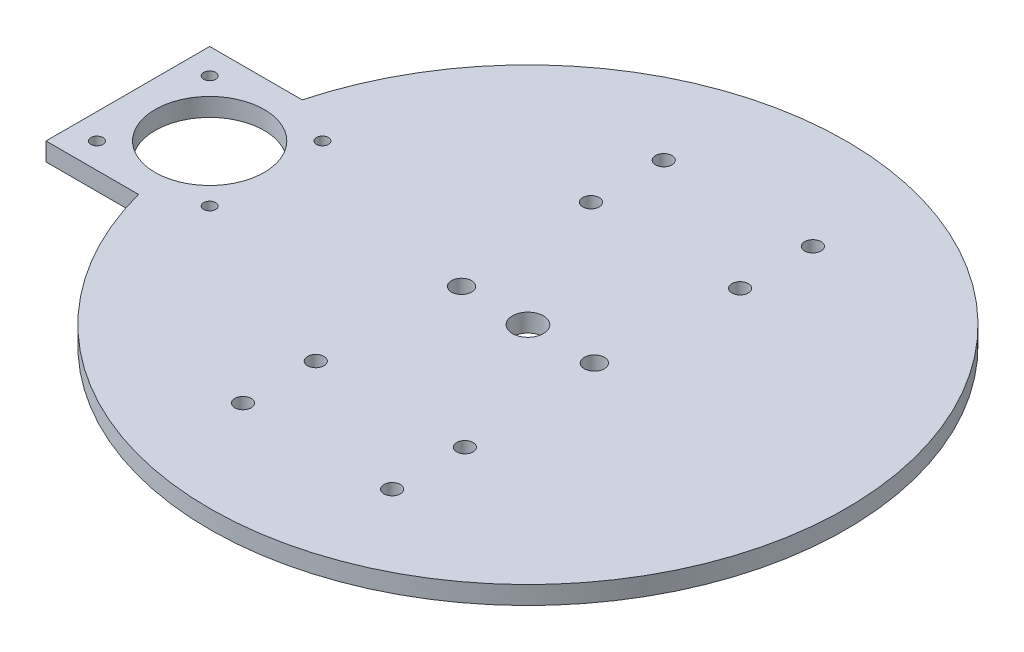
ISO-10303-21;
HEADER;
FILE_DESCRIPTION(('STEP AP214'),'2;1');
FILE_NAME('part.step','',(''),(''),'','','');
FILE_SCHEMA(('AUTOMOTIVE_DESIGN { 1 0 10303 214 1 1 1 1 }'));
ENDSEC;
DATA;
#1=APPLICATION_CONTEXT('core data for automotive mechanical design processes');
#2=APPLICATION_PROTOCOL_DEFINITION('international standard','automotive_design',2000,#1);
#3=PRODUCT_CONTEXT('',#1,'mechanical');
#4=PRODUCT('Part','Part','',(#3));
#5=PRODUCT_RELATED_PRODUCT_CATEGORY('part','',(#4));
#6=PRODUCT_DEFINITION_FORMATION('','',#4);
#7=PRODUCT_DEFINITION_CONTEXT('part definition',#1,'design');
#8=PRODUCT_DEFINITION('design','',#6,#7);
#9=PRODUCT_DEFINITION_SHAPE('','',#8);
#10=(LENGTH_UNIT() NAMED_UNIT(*) SI_UNIT(.MILLI.,.METRE.));
#11=(NAMED_UNIT(*) PLANE_ANGLE_UNIT() SI_UNIT($,.RADIAN.));
#12=(NAMED_UNIT(*) SI_UNIT($,.STERADIAN.) SOLID_ANGLE_UNIT());
#13=UNCERTAINTY_MEASURE_WITH_UNIT(LENGTH_MEASURE(1.E-05),#10,'distance_accuracy_value','');
#14=(GEOMETRIC_REPRESENTATION_CONTEXT(3) GLOBAL_UNCERTAINTY_ASSIGNED_CONTEXT((#13)) GLOBAL_UNIT_ASSIGNED_CONTEXT((#10,
#11,#12)) REPRESENTATION_CONTEXT('',''));
#15=CARTESIAN_POINT('',(0.,0.,0.));
#16=DIRECTION('',(0.,0.,1.));
#17=DIRECTION('',(1.,0.,0.));
#18=AXIS2_PLACEMENT_3D('',#15,#16,#17);
#19=CARTESIAN_POINT('',(20.5,5.,57.8302078853901));
#20=DIRECTION('',(0.,-1.,0.));
#21=DIRECTION('',(0.,0.,-1.));
#22=AXIS2_PLACEMENT_3D('',#19,#20,#21);
#23=CYLINDRICAL_SURFACE('',#22,2.25);
#24=CARTESIAN_POINT('',(20.5,5.,57.8302078853901));
#25=DIRECTION('',(0.,1.,0.));
#26=DIRECTION('',(0.,0.,1.));
#27=AXIS2_PLACEMENT_3D('',#24,#25,#26);
#28=CIRCLE('',#27,2.25);
#29=CARTESIAN_POINT('',(20.5,5.,60.0802078853901));
#30=VERTEX_POINT('',#29);
#31=EDGE_CURVE('E208',#30,#30,#28,.F.);
#32=ORIENTED_EDGE('',*,*,#31,.F.);
#33=EDGE_LOOP('',(#32));
#34=FACE_BOUND('',#33,.T.);
#35=CARTESIAN_POINT('',(20.5,0.,57.8302078853901));
#36=DIRECTION('',(0.,1.,0.));
#37=DIRECTION('',(0.,0.,1.));
#38=AXIS2_PLACEMENT_3D('',#35,#36,#37);
#39=CIRCLE('',#38,2.25);
#40=CARTESIAN_POINT('',(20.5,0.,60.0802078853901));
#41=VERTEX_POINT('',#40);
#42=EDGE_CURVE('E258',#41,#41,#39,.F.);
#43=ORIENTED_EDGE('',*,*,#42,.T.);
#44=EDGE_LOOP('',(#43));
#45=FACE_BOUND('',#44,.T.);
#46=ADVANCED_FACE('F109',(#34,#45),#23,.F.);
#47=CARTESIAN_POINT('',(-20.5,5.,57.8302078853901));
#48=DIRECTION('',(0.,-1.,0.));
#49=DIRECTION('',(0.,0.,-1.));
#50=AXIS2_PLACEMENT_3D('',#47,#48,#49);
#51=CYLINDRICAL_SURFACE('',#50,2.25);
#52=CARTESIAN_POINT('',(-20.5,5.,57.8302078853901));
#53=DIRECTION('',(0.,1.,0.));
#54=DIRECTION('',(0.,0.,1.));
#55=AXIS2_PLACEMENT_3D('',#52,#53,#54);
#56=CIRCLE('',#55,2.25);
#57=CARTESIAN_POINT('',(-20.5,5.,60.0802078853901));
#58=VERTEX_POINT('',#57);
#59=EDGE_CURVE('E205',#58,#58,#56,.F.);
#60=ORIENTED_EDGE('',*,*,#59,.F.);
#61=EDGE_LOOP('',(#60));
#62=FACE_BOUND('',#61,.T.);
#63=CARTESIAN_POINT('',(-20.5,0.,57.8302078853901));
#64=DIRECTION('',(0.,1.,0.));
#65=DIRECTION('',(0.,0.,1.));
#66=AXIS2_PLACEMENT_3D('',#63,#64,#65);
#67=CIRCLE('',#66,2.25);
#68=CARTESIAN_POINT('',(-20.5,0.,60.0802078853901));
#69=VERTEX_POINT('',#68);
#70=EDGE_CURVE('E255',#69,#69,#67,.F.);
#71=ORIENTED_EDGE('',*,*,#70,.T.);
#72=EDGE_LOOP('',(#71));
#73=FACE_BOUND('',#72,.T.);
#74=ADVANCED_FACE('F287',(#62,#73),#51,.F.);
#75=CARTESIAN_POINT('',(20.5,5.,37.8302078853901));
#76=DIRECTION('',(0.,-1.,0.));
#77=DIRECTION('',(0.,0.,-1.));
#78=AXIS2_PLACEMENT_3D('',#75,#76,#77);
#79=CYLINDRICAL_SURFACE('',#78,2.25000000000019);
#80=CARTESIAN_POINT('',(20.5,5.,37.8302078853901));
#81=DIRECTION('',(0.,1.,0.));
#82=DIRECTION('',(0.,0.,1.));
#83=AXIS2_PLACEMENT_3D('',#80,#81,#82);
#84=CIRCLE('',#83,2.25000000000019);
#85=CARTESIAN_POINT('',(20.5,5.,40.0802078853902));
#86=VERTEX_POINT('',#85);
#87=EDGE_CURVE('E202',#86,#86,#84,.F.);
#88=ORIENTED_EDGE('',*,*,#87,.F.);
#89=EDGE_LOOP('',(#88));
#90=FACE_BOUND('',#89,.T.);
#91=CARTESIAN_POINT('',(20.5,0.,37.8302078853901));
#92=DIRECTION('',(0.,1.,0.));
#93=DIRECTION('',(0.,0.,1.));
#94=AXIS2_PLACEMENT_3D('',#91,#92,#93);
#95=CIRCLE('',#94,2.25000000000019);
#96=CARTESIAN_POINT('',(20.5,0.,40.0802078853902));
#97=VERTEX_POINT('',#96);
#98=EDGE_CURVE('E252',#97,#97,#95,.F.);
#99=ORIENTED_EDGE('',*,*,#98,.T.);
#100=EDGE_LOOP('',(#99));
#101=FACE_BOUND('',#100,.T.);
#102=ADVANCED_FACE('F293',(#90,#101),#79,.F.);
#103=CARTESIAN_POINT('',(-72.,5.,-15.5));
#104=DIRECTION('',(0.,-1.,0.));
#105=DIRECTION('',(0.,0.,-1.));
#106=AXIS2_PLACEMENT_3D('',#103,#104,#105);
#107=CYLINDRICAL_SURFACE('',#106,1.65);
#108=CARTESIAN_POINT('',(-72.,5.,-15.5));
#109=DIRECTION('',(0.,1.,0.));
#110=DIRECTION('',(0.,0.,1.));
#111=AXIS2_PLACEMENT_3D('',#108,#109,#110);
#112=CIRCLE('',#111,1.65);
#113=CARTESIAN_POINT('',(-72.,5.,-13.85));
#114=VERTEX_POINT('',#113);
#115=EDGE_CURVE('E199',#114,#114,#112,.T.);
#116=ORIENTED_EDGE('',*,*,#115,.T.);
#117=EDGE_LOOP('',(#116));
#118=FACE_BOUND('',#117,.T.);
#119=CARTESIAN_POINT('',(-72.,0.,-15.5));
#120=DIRECTION('',(0.,1.,0.));
#121=DIRECTION('',(0.,0.,1.));
#122=AXIS2_PLACEMENT_3D('',#119,#120,#121);
#123=CIRCLE('',#122,1.65);
#124=CARTESIAN_POINT('',(-72.,0.,-13.85));
#125=VERTEX_POINT('',#124);
#126=EDGE_CURVE('E249',#125,#125,#123,.T.);
#127=ORIENTED_EDGE('',*,*,#126,.F.);
#128=EDGE_LOOP('',(#127));
#129=FACE_BOUND('',#128,.T.);
#130=ADVANCED_FACE('F302',(#118,#129),#107,.F.);
#131=CARTESIAN_POINT('',(-71.9999999999997,5.,15.5));
#132=DIRECTION('',(0.,-1.,0.));
#133=DIRECTION('',(0.,0.,-1.));
#134=AXIS2_PLACEMENT_3D('',#131,#132,#133);
#135=CYLINDRICAL_SURFACE('',#134,1.65);
#136=CARTESIAN_POINT('',(-71.9999999999997,5.,15.5));
#137=DIRECTION('',(0.,1.,0.));
#138=DIRECTION('',(0.,0.,1.));
#139=AXIS2_PLACEMENT_3D('',#136,#137,#138);
#140=CIRCLE('',#139,1.65);
#141=CARTESIAN_POINT('',(-71.9999999999997,5.,17.15));
#142=VERTEX_POINT('',#141);
#143=EDGE_CURVE('E196',#142,#142,#140,.T.);
#144=ORIENTED_EDGE('',*,*,#143,.T.);
#145=EDGE_LOOP('',(#144));
#146=FACE_BOUND('',#145,.T.);
#147=CARTESIAN_POINT('',(-71.9999999999997,0.,15.5));
#148=DIRECTION('',(0.,1.,0.));
#149=DIRECTION('',(0.,0.,1.));
#150=AXIS2_PLACEMENT_3D('',#147,#148,#149);
#151=CIRCLE('',#150,1.65);
#152=CARTESIAN_POINT('',(-71.9999999999997,0.,17.15));
#153=VERTEX_POINT('',#152);
#154=EDGE_CURVE('E246',#153,#153,#151,.T.);
#155=ORIENTED_EDGE('',*,*,#154,.F.);
#156=EDGE_LOOP('',(#155));
#157=FACE_BOUND('',#156,.T.);
#158=ADVANCED_FACE('F306',(#146,#157),#135,.F.);
#159=CARTESIAN_POINT('',(0.,5.,0.));
#160=DIRECTION('',(0.,-1.,0.));
#161=DIRECTION('',(0.,0.,-1.));
#162=AXIS2_PLACEMENT_3D('',#159,#160,#161);
#163=CYLINDRICAL_SURFACE('',#162,4.25);
#164=CARTESIAN_POINT('',(0.,5.,0.));
#165=DIRECTION('',(0.,1.,0.));
#166=DIRECTION('',(0.,0.,1.));
#167=AXIS2_PLACEMENT_3D('',#164,#165,#166);
#168=CIRCLE('',#167,4.25);
#169=CARTESIAN_POINT('',(0.,5.,4.25));
#170=VERTEX_POINT('',#169);
#171=EDGE_CURVE('E193',#170,#170,#168,.T.);
#172=ORIENTED_EDGE('',*,*,#171,.T.);
#173=EDGE_LOOP('',(#172));
#174=FACE_BOUND('',#173,.T.);
#175=CARTESIAN_POINT('',(0.,0.,0.));
#176=DIRECTION('',(0.,1.,0.));
#177=DIRECTION('',(0.,0.,1.));
#178=AXIS2_PLACEMENT_3D('',#175,#176,#177);
#179=CIRCLE('',#178,4.25);
#180=CARTESIAN_POINT('',(0.,0.,4.25));
#181=VERTEX_POINT('',#180);
#182=EDGE_CURVE('E243',#181,#181,#179,.T.);
#183=ORIENTED_EDGE('',*,*,#182,.F.);
#184=EDGE_LOOP('',(#183));
#185=FACE_BOUND('',#184,.T.);
#186=ADVANCED_FACE('F310',(#174,#185),#163,.F.);
#187=CARTESIAN_POINT('',(18.25,5.,0.));
#188=DIRECTION('',(0.,-1.,0.));
#189=DIRECTION('',(0.,0.,-1.));
#190=AXIS2_PLACEMENT_3D('',#187,#188,#189);
#191=CYLINDRICAL_SURFACE('',#190,2.75);
#192=CARTESIAN_POINT('',(18.25,5.,0.));
#193=DIRECTION('',(0.,1.,0.));
#194=DIRECTION('',(0.,0.,1.));
#195=AXIS2_PLACEMENT_3D('',#192,#193,#194);
#196=CIRCLE('',#195,2.75);
#197=CARTESIAN_POINT('',(18.25,5.,2.75));
#198=VERTEX_POINT('',#197);
#199=EDGE_CURVE('E190',#198,#198,#196,.T.);
#200=ORIENTED_EDGE('',*,*,#199,.T.);
#201=EDGE_LOOP('',(#200));
#202=FACE_BOUND('',#201,.T.);
#203=CARTESIAN_POINT('',(18.25,0.,0.));
#204=DIRECTION('',(0.,1.,0.));
#205=DIRECTION('',(0.,0.,1.));
#206=AXIS2_PLACEMENT_3D('',#203,#204,#205);
#207=CIRCLE('',#206,2.75);
#208=CARTESIAN_POINT('',(18.25,0.,2.75));
#209=VERTEX_POINT('',#208);
#210=EDGE_CURVE('E240',#209,#209,#207,.T.);
#211=ORIENTED_EDGE('',*,*,#210,.F.);
#212=EDGE_LOOP('',(#211));
#213=FACE_BOUND('',#212,.T.);
#214=ADVANCED_FACE('F314',(#202,#213),#191,.F.);
#215=CARTESIAN_POINT('',(-18.25,5.,0.));
#216=DIRECTION('',(0.,-1.,0.));
#217=DIRECTION('',(0.,0.,-1.));
#218=AXIS2_PLACEMENT_3D('',#215,#216,#217);
#219=CYLINDRICAL_SURFACE('',#218,2.75);
#220=CARTESIAN_POINT('',(-18.25,5.,0.));
#221=DIRECTION('',(0.,1.,0.));
#222=DIRECTION('',(0.,0.,1.));
#223=AXIS2_PLACEMENT_3D('',#220,#221,#222);
#224=CIRCLE('',#223,2.75);
#225=CARTESIAN_POINT('',(-18.25,5.,2.75));
#226=VERTEX_POINT('',#225);
#227=EDGE_CURVE('E187',#226,#226,#224,.T.);
#228=ORIENTED_EDGE('',*,*,#227,.T.);
#229=EDGE_LOOP('',(#228));
#230=FACE_BOUND('',#229,.T.);
#231=CARTESIAN_POINT('',(-18.25,0.,0.));
#232=DIRECTION('',(0.,1.,0.));
#233=DIRECTION('',(0.,0.,1.));
#234=AXIS2_PLACEMENT_3D('',#231,#232,#233);
#235=CIRCLE('',#234,2.75);
#236=CARTESIAN_POINT('',(-18.25,0.,2.75));
#237=VERTEX_POINT('',#236);
#238=EDGE_CURVE('E237',#237,#237,#235,.T.);
#239=ORIENTED_EDGE('',*,*,#238,.F.);
#240=EDGE_LOOP('',(#239));
#241=FACE_BOUND('',#240,.T.);
#242=ADVANCED_FACE('F318',(#230,#241),#219,.F.);
#243=CARTESIAN_POINT('',(20.5000000000002,5.,-37.8302078853901));
#244=DIRECTION('',(0.,-1.,0.));
#245=DIRECTION('',(0.,0.,-1.));
#246=AXIS2_PLACEMENT_3D('',#243,#244,#245);
#247=CYLINDRICAL_SURFACE('',#246,2.25);
#248=CARTESIAN_POINT('',(20.5000000000002,5.,-37.8302078853901));
#249=DIRECTION('',(0.,1.,0.));
#250=DIRECTION('',(0.,0.,1.));
#251=AXIS2_PLACEMENT_3D('',#248,#249,#250);
#252=CIRCLE('',#251,2.25);
#253=CARTESIAN_POINT('',(20.5000000000002,5.,-35.58020788539));
#254=VERTEX_POINT('',#253);
#255=EDGE_CURVE('E184',#254,#254,#252,.T.);
#256=ORIENTED_EDGE('',*,*,#255,.T.);
#257=EDGE_LOOP('',(#256));
#258=FACE_BOUND('',#257,.T.);
#259=CARTESIAN_POINT('',(20.5000000000002,0.,-37.8302078853901));
#260=DIRECTION('',(0.,1.,0.));
#261=DIRECTION('',(0.,0.,1.));
#262=AXIS2_PLACEMENT_3D('',#259,#260,#261);
#263=CIRCLE('',#262,2.25);
#264=CARTESIAN_POINT('',(20.5000000000002,0.,-35.58020788539));
#265=VERTEX_POINT('',#264);
#266=EDGE_CURVE('E234',#265,#265,#263,.T.);
#267=ORIENTED_EDGE('',*,*,#266,.F.);
#268=EDGE_LOOP('',(#267));
#269=FACE_BOUND('',#268,.T.);
#270=ADVANCED_FACE('F322',(#258,#269),#247,.F.);
#271=CARTESIAN_POINT('',(-20.4999999999998,5.,-37.8302078853901));
#272=DIRECTION('',(0.,-1.,0.));
#273=DIRECTION('',(0.,0.,-1.));
#274=AXIS2_PLACEMENT_3D('',#271,#272,#273);
#275=CYLINDRICAL_SURFACE('',#274,2.25);
#276=CARTESIAN_POINT('',(-20.4999999999998,5.,-37.8302078853901));
#277=DIRECTION('',(0.,1.,0.));
#278=DIRECTION('',(0.,0.,1.));
#279=AXIS2_PLACEMENT_3D('',#276,#277,#278);
#280=CIRCLE('',#279,2.25);
#281=CARTESIAN_POINT('',(-20.4999999999998,5.,-35.58020788539));
#282=VERTEX_POINT('',#281);
#283=EDGE_CURVE('E181',#282,#282,#280,.T.);
#284=ORIENTED_EDGE('',*,*,#283,.T.);
#285=EDGE_LOOP('',(#284));
#286=FACE_BOUND('',#285,.T.);
#287=CARTESIAN_POINT('',(-20.4999999999998,0.,-37.8302078853901));
#288=DIRECTION('',(0.,1.,0.));
#289=DIRECTION('',(0.,0.,1.));
#290=AXIS2_PLACEMENT_3D('',#287,#288,#289);
#291=CIRCLE('',#290,2.25);
#292=CARTESIAN_POINT('',(-20.4999999999998,0.,-35.58020788539));
#293=VERTEX_POINT('',#292);
#294=EDGE_CURVE('E231',#293,#293,#291,.T.);
#295=ORIENTED_EDGE('',*,*,#294,.F.);
#296=EDGE_LOOP('',(#295));
#297=FACE_BOUND('',#296,.T.);
#298=ADVANCED_FACE('F326',(#286,#297),#275,.F.);
#299=CARTESIAN_POINT('',(-20.5,5.,37.8302078853901));
#300=DIRECTION('',(0.,-1.,0.));
#301=DIRECTION('',(0.,0.,-1.));
#302=AXIS2_PLACEMENT_3D('',#299,#300,#301);
#303=CYLINDRICAL_SURFACE('',#302,2.25000000000019);
#304=CARTESIAN_POINT('',(-20.5,5.,37.8302078853901));
#305=DIRECTION('',(0.,1.,0.));
#306=DIRECTION('',(0.,0.,1.));
#307=AXIS2_PLACEMENT_3D('',#304,#305,#306);
#308=CIRCLE('',#307,2.25000000000019);
#309=CARTESIAN_POINT('',(-20.5,5.,40.0802078853902));
#310=VERTEX_POINT('',#309);
#311=EDGE_CURVE('E178',#310,#310,#308,.F.);
#312=ORIENTED_EDGE('',*,*,#311,.F.);
#313=EDGE_LOOP('',(#312));
#314=FACE_BOUND('',#313,.T.);
#315=CARTESIAN_POINT('',(-20.5,0.,37.8302078853901));
#316=DIRECTION('',(0.,1.,0.));
#317=DIRECTION('',(0.,0.,1.));
#318=AXIS2_PLACEMENT_3D('',#315,#316,#317);
#319=CIRCLE('',#318,2.25000000000019);
#320=CARTESIAN_POINT('',(-20.5,0.,40.0802078853902));
#321=VERTEX_POINT('',#320);
#322=EDGE_CURVE('E228',#321,#321,#319,.F.);
#323=ORIENTED_EDGE('',*,*,#322,.T.);
#324=EDGE_LOOP('',(#323));
#325=FACE_BOUND('',#324,.T.);
#326=ADVANCED_FACE('F330',(#314,#325),#303,.F.);
#327=CARTESIAN_POINT('',(0.,5.,-22.5));
#328=DIRECTION('',(0.,0.,-1.));
#329=DIRECTION('',(-1.,0.,0.));
#330=AXIS2_PLACEMENT_3D('',#327,#328,#329);
#331=PLANE('',#330);
#332=DIRECTION('',(1.,0.,0.));
#333=VECTOR('',#332,1.);
#334=CARTESIAN_POINT('',(0.,0.,-22.5));
#335=LINE('',#334,#333);
#336=CARTESIAN_POINT('',(-110.,0.,-22.5));
#337=VERTEX_POINT('',#336);
#338=CARTESIAN_POINT('',(-84.5576726264388,0.,-22.5));
#339=VERTEX_POINT('',#338);
#340=EDGE_CURVE('E164',#337,#339,#335,.T.);
#341=ORIENTED_EDGE('',*,*,#340,.F.);
#342=DIRECTION('',(0.,-1.,0.));
#343=VECTOR('',#342,1.);
#344=CARTESIAN_POINT('',(-110.,5.,-22.5));
#345=LINE('',#344,#343);
#346=CARTESIAN_POINT('',(-110.,5.,-22.5));
#347=VERTEX_POINT('',#346);
#348=EDGE_CURVE('E119',#347,#337,#345,.T.);
#349=ORIENTED_EDGE('',*,*,#348,.F.);
#350=DIRECTION('',(1.,0.,0.));
#351=VECTOR('',#350,1.);
#352=CARTESIAN_POINT('',(0.,5.,-22.5));
#353=LINE('',#352,#351);
#354=CARTESIAN_POINT('',(-84.5576726264388,5.,-22.5));
#355=VERTEX_POINT('',#354);
#356=EDGE_CURVE('E162',#347,#355,#353,.T.);
#357=ORIENTED_EDGE('',*,*,#356,.T.);
#358=DIRECTION('',(0.,-1.,0.));
#359=VECTOR('',#358,1.);
#360=CARTESIAN_POINT('',(-84.5576726264388,5.,-22.5));
#361=LINE('',#360,#359);
#362=EDGE_CURVE('E12',#355,#339,#361,.T.);
#363=ORIENTED_EDGE('',*,*,#362,.T.);
#364=EDGE_LOOP('',(#341,#349,#357,#363));
#365=FACE_BOUND('',#364,.T.);
#366=ADVANCED_FACE('F161',(#365),#331,.T.);
#367=CARTESIAN_POINT('',(-110.,5.,0.));
#368=DIRECTION('',(1.,0.,0.));
#369=DIRECTION('',(0.,0.,-1.));
#370=AXIS2_PLACEMENT_3D('',#367,#368,#369);
#371=PLANE('',#370);
#372=DIRECTION('',(0.,0.,1.));
#373=VECTOR('',#372,1.);
#374=CARTESIAN_POINT('',(-110.,0.,0.));
#375=LINE('',#374,#373);
#376=CARTESIAN_POINT('',(-110.,0.,22.5));
#377=VERTEX_POINT('',#376);
#378=EDGE_CURVE('E143',#337,#377,#375,.T.);
#379=ORIENTED_EDGE('',*,*,#378,.T.);
#380=DIRECTION('',(0.,-1.,0.));
#381=VECTOR('',#380,1.);
#382=CARTESIAN_POINT('',(-110.,5.,22.5));
#383=LINE('',#382,#381);
#384=CARTESIAN_POINT('',(-110.,5.,22.5));
#385=VERTEX_POINT('',#384);
#386=EDGE_CURVE('E165',#385,#377,#383,.T.);
#387=ORIENTED_EDGE('',*,*,#386,.F.);
#388=DIRECTION('',(0.,0.,1.));
#389=VECTOR('',#388,1.);
#390=CARTESIAN_POINT('',(-110.,5.,0.));
#391=LINE('',#390,#389);
#392=EDGE_CURVE('E167',#347,#385,#391,.T.);
#393=ORIENTED_EDGE('',*,*,#392,.F.);
#394=ORIENTED_EDGE('',*,*,#348,.T.);
#395=EDGE_LOOP('',(#379,#387,#393,#394));
#396=FACE_BOUND('',#395,.T.);
#397=ADVANCED_FACE('F168',(#396),#371,.F.);
#398=CARTESIAN_POINT('',(0.,5.,22.5));
#399=DIRECTION('',(0.,0.,-1.));
#400=DIRECTION('',(-1.,0.,0.));
#401=AXIS2_PLACEMENT_3D('',#398,#399,#400);
#402=PLANE('',#401);
#403=DIRECTION('',(1.,0.,0.));
#404=VECTOR('',#403,1.);
#405=CARTESIAN_POINT('',(0.,0.,22.5));
#406=LINE('',#405,#404);
#407=CARTESIAN_POINT('',(-84.5576726264388,0.,22.5));
#408=VERTEX_POINT('',#407);
#409=EDGE_CURVE('E149',#377,#408,#406,.T.);
#410=ORIENTED_EDGE('',*,*,#409,.T.);
#411=DIRECTION('',(0.,-1.,0.));
#412=VECTOR('',#411,1.);
#413=CARTESIAN_POINT('',(-84.5576726264388,5.,22.5));
#414=LINE('',#413,#412);
#415=CARTESIAN_POINT('',(-84.5576726264388,5.,22.5));
#416=VERTEX_POINT('',#415);
#417=EDGE_CURVE('E211',#416,#408,#414,.T.);
#418=ORIENTED_EDGE('',*,*,#417,.F.);
#419=DIRECTION('',(1.,0.,0.));
#420=VECTOR('',#419,1.);
#421=CARTESIAN_POINT('',(0.,5.,22.5));
#422=LINE('',#421,#420);
#423=EDGE_CURVE('E128',#385,#416,#422,.T.);
#424=ORIENTED_EDGE('',*,*,#423,.F.);
#425=ORIENTED_EDGE('',*,*,#386,.T.);
#426=EDGE_LOOP('',(#410,#418,#424,#425));
#427=FACE_BOUND('',#426,.T.);
#428=ADVANCED_FACE('F335',(#427),#402,.F.);
#429=CARTESIAN_POINT('',(0.,5.,0.));
#430=DIRECTION('',(0.,-1.,0.));
#431=DIRECTION('',(0.,0.,-1.));
#432=AXIS2_PLACEMENT_3D('',#429,#430,#431);
#433=CYLINDRICAL_SURFACE('',#432,87.5);
#434=CARTESIAN_POINT('',(0.,0.,0.));
#435=DIRECTION('',(0.,1.,0.));
#436=DIRECTION('',(0.,0.,1.));
#437=AXIS2_PLACEMENT_3D('',#434,#435,#436);
#438=CIRCLE('',#437,87.5);
#439=EDGE_CURVE('E222',#408,#339,#438,.T.);
#440=ORIENTED_EDGE('',*,*,#439,.T.);
#441=ORIENTED_EDGE('',*,*,#362,.F.);
#442=CARTESIAN_POINT('',(0.,5.,0.));
#443=DIRECTION('',(0.,1.,0.));
#444=DIRECTION('',(0.,0.,1.));
#445=AXIS2_PLACEMENT_3D('',#442,#443,#444);
#446=CIRCLE('',#445,87.5);
#447=EDGE_CURVE('E154',#416,#355,#446,.T.);
#448=ORIENTED_EDGE('',*,*,#447,.F.);
#449=ORIENTED_EDGE('',*,*,#417,.T.);
#450=EDGE_LOOP('',(#440,#441,#448,#449));
#451=FACE_BOUND('',#450,.T.);
#452=ADVANCED_FACE('F338',(#451),#433,.T.);
#453=CARTESIAN_POINT('',(-103.,5.,-15.5));
#454=DIRECTION('',(0.,-1.,0.));
#455=DIRECTION('',(0.,0.,-1.));
#456=AXIS2_PLACEMENT_3D('',#453,#454,#455);
#457=CYLINDRICAL_SURFACE('',#456,1.65);
#458=CARTESIAN_POINT('',(-103.,5.,-15.5));
#459=DIRECTION('',(0.,1.,0.));
#460=DIRECTION('',(0.,0.,1.));
#461=AXIS2_PLACEMENT_3D('',#458,#459,#460);
#462=CIRCLE('',#461,1.65);
#463=CARTESIAN_POINT('',(-103.,5.,-13.85));
#464=VERTEX_POINT('',#463);
#465=EDGE_CURVE('E173',#464,#464,#462,.T.);
#466=ORIENTED_EDGE('',*,*,#465,.T.);
#467=EDGE_LOOP('',(#466));
#468=FACE_BOUND('',#467,.T.);
#469=CARTESIAN_POINT('',(-103.,0.,-15.5));
#470=DIRECTION('',(0.,1.,0.));
#471=DIRECTION('',(0.,0.,1.));
#472=AXIS2_PLACEMENT_3D('',#469,#470,#471);
#473=CIRCLE('',#472,1.65);
#474=CARTESIAN_POINT('',(-103.,0.,-13.85));
#475=VERTEX_POINT('',#474);
#476=EDGE_CURVE('E219',#475,#475,#473,.T.);
#477=ORIENTED_EDGE('',*,*,#476,.F.);
#478=EDGE_LOOP('',(#477));
#479=FACE_BOUND('',#478,.T.);
#480=ADVANCED_FACE('F345',(#468,#479),#457,.F.);
#481=CARTESIAN_POINT('',(-103.,5.,15.5));
#482=DIRECTION('',(0.,-1.,0.));
#483=DIRECTION('',(0.,0.,-1.));
#484=AXIS2_PLACEMENT_3D('',#481,#482,#483);
#485=CYLINDRICAL_SURFACE('',#484,1.65);
#486=CARTESIAN_POINT('',(-103.,5.,15.5));
#487=DIRECTION('',(0.,1.,0.));
#488=DIRECTION('',(0.,0.,1.));
#489=AXIS2_PLACEMENT_3D('',#486,#487,#488);
#490=CIRCLE('',#489,1.65);
#491=CARTESIAN_POINT('',(-103.,5.,17.15));
#492=VERTEX_POINT('',#491);
#493=EDGE_CURVE('E408',#492,#492,#490,.T.);
#494=ORIENTED_EDGE('',*,*,#493,.T.);
#495=EDGE_LOOP('',(#494));
#496=FACE_BOUND('',#495,.T.);
#497=CARTESIAN_POINT('',(-103.,0.,15.5));
#498=DIRECTION('',(0.,1.,0.));
#499=DIRECTION('',(0.,0.,1.));
#500=AXIS2_PLACEMENT_3D('',#497,#498,#499);
#501=CIRCLE('',#500,1.65);
#502=CARTESIAN_POINT('',(-103.,0.,17.15));
#503=VERTEX_POINT('',#502);
#504=EDGE_CURVE('E215',#503,#503,#501,.T.);
#505=ORIENTED_EDGE('',*,*,#504,.F.);
#506=EDGE_LOOP('',(#505));
#507=FACE_BOUND('',#506,.T.);
#508=ADVANCED_FACE('F349',(#496,#507),#485,.F.);
#509=CARTESIAN_POINT('',(-87.5,5.,0.));
#510=DIRECTION('',(0.,-1.,0.));
#511=DIRECTION('',(0.,0.,-1.));
#512=AXIS2_PLACEMENT_3D('',#509,#510,#511);
#513=CYLINDRICAL_SURFACE('',#512,15.);
#514=CARTESIAN_POINT('',(-87.5,5.,0.));
#515=DIRECTION('',(0.,1.,0.));
#516=DIRECTION('',(0.,0.,1.));
#517=AXIS2_PLACEMENT_3D('',#514,#515,#516);
#518=CIRCLE('',#517,15.);
#519=CARTESIAN_POINT('',(-87.5,5.,15.));
#520=VERTEX_POINT('',#519);
#521=EDGE_CURVE('E261',#520,#520,#518,.T.);
#522=ORIENTED_EDGE('',*,*,#521,.T.);
#523=EDGE_LOOP('',(#522));
#524=FACE_BOUND('',#523,.T.);
#525=CARTESIAN_POINT('',(-87.5,0.,0.));
#526=DIRECTION('',(0.,1.,0.));
#527=DIRECTION('',(0.,0.,1.));
#528=AXIS2_PLACEMENT_3D('',#525,#526,#527);
#529=CIRCLE('',#528,15.);
#530=CARTESIAN_POINT('',(-87.5,0.,15.));
#531=VERTEX_POINT('',#530);
#532=EDGE_CURVE('E212',#531,#531,#529,.T.);
#533=ORIENTED_EDGE('',*,*,#532,.F.);
#534=EDGE_LOOP('',(#533));
#535=FACE_BOUND('',#534,.T.);
#536=ADVANCED_FACE('F353',(#524,#535),#513,.F.);
#537=CARTESIAN_POINT('',(0.,0.,0.));
#538=DIRECTION('',(0.,1.,0.));
#539=DIRECTION('',(0.,0.,1.));
#540=AXIS2_PLACEMENT_3D('',#537,#538,#539);
#541=PLANE('',#540);
#542=ORIENTED_EDGE('',*,*,#532,.T.);
#543=EDGE_LOOP('',(#542));
#544=FACE_BOUND('',#543,.T.);
#545=ORIENTED_EDGE('',*,*,#504,.T.);
#546=EDGE_LOOP('',(#545));
#547=FACE_BOUND('',#546,.T.);
#548=ORIENTED_EDGE('',*,*,#476,.T.);
#549=EDGE_LOOP('',(#548));
#550=FACE_BOUND('',#549,.T.);
#551=ORIENTED_EDGE('',*,*,#439,.F.);
#552=ORIENTED_EDGE('',*,*,#409,.F.);
#553=ORIENTED_EDGE('',*,*,#378,.F.);
#554=ORIENTED_EDGE('',*,*,#340,.T.);
#555=EDGE_LOOP('',(#551,#552,#553,#554));
#556=FACE_BOUND('',#555,.T.);
#557=ORIENTED_EDGE('',*,*,#322,.F.);
#558=EDGE_LOOP('',(#557));
#559=FACE_BOUND('',#558,.T.);
#560=ORIENTED_EDGE('',*,*,#294,.T.);
#561=EDGE_LOOP('',(#560));
#562=FACE_BOUND('',#561,.T.);
#563=ORIENTED_EDGE('',*,*,#266,.T.);
#564=EDGE_LOOP('',(#563));
#565=FACE_BOUND('',#564,.T.);
#566=ORIENTED_EDGE('',*,*,#238,.T.);
#567=EDGE_LOOP('',(#566));
#568=FACE_BOUND('',#567,.T.);
#569=ORIENTED_EDGE('',*,*,#210,.T.);
#570=EDGE_LOOP('',(#569));
#571=FACE_BOUND('',#570,.T.);
#572=ORIENTED_EDGE('',*,*,#182,.T.);
#573=EDGE_LOOP('',(#572));
#574=FACE_BOUND('',#573,.T.);
#575=ORIENTED_EDGE('',*,*,#154,.T.);
#576=EDGE_LOOP('',(#575));
#577=FACE_BOUND('',#576,.T.);
#578=ORIENTED_EDGE('',*,*,#126,.T.);
#579=EDGE_LOOP('',(#578));
#580=FACE_BOUND('',#579,.T.);
#581=ORIENTED_EDGE('',*,*,#98,.F.);
#582=EDGE_LOOP('',(#581));
#583=FACE_BOUND('',#582,.T.);
#584=ORIENTED_EDGE('',*,*,#70,.F.);
#585=EDGE_LOOP('',(#584));
#586=FACE_BOUND('',#585,.T.);
#587=ORIENTED_EDGE('',*,*,#42,.F.);
#588=EDGE_LOOP('',(#587));
#589=FACE_BOUND('',#588,.T.);
#590=CARTESIAN_POINT('',(-20.5,0.,-57.8302078853901));
#591=DIRECTION('',(0.,1.,0.));
#592=DIRECTION('',(0.,0.,1.));
#593=AXIS2_PLACEMENT_3D('',#590,#591,#592);
#594=CIRCLE('',#593,2.25);
#595=CARTESIAN_POINT('',(-20.5,0.,-55.5802078853901));
#596=VERTEX_POINT('',#595);
#597=EDGE_CURVE('E266',#596,#596,#594,.T.);
#598=ORIENTED_EDGE('',*,*,#597,.T.);
#599=EDGE_LOOP('',(#598));
#600=FACE_BOUND('',#599,.T.);
#601=CARTESIAN_POINT('',(20.5,0.,-57.8302078853901));
#602=DIRECTION('',(0.,1.,0.));
#603=DIRECTION('',(0.,0.,1.));
#604=AXIS2_PLACEMENT_3D('',#601,#602,#603);
#605=CIRCLE('',#604,2.25);
#606=CARTESIAN_POINT('',(20.5,0.,-55.5802078853901));
#607=VERTEX_POINT('',#606);
#608=EDGE_CURVE('E113',#607,#607,#605,.T.);
#609=ORIENTED_EDGE('',*,*,#608,.T.);
#610=EDGE_LOOP('',(#609));
#611=FACE_BOUND('',#610,.T.);
#612=ADVANCED_FACE('F275',(#544,#547,#550,#556,#559,#562,#565,#568,#571,#574,#577,#580,#583,
#586,#589,#600,#611),#541,.F.);
#613=CARTESIAN_POINT('',(0.,5.,0.));
#614=DIRECTION('',(0.,1.,0.));
#615=DIRECTION('',(0.,0.,1.));
#616=AXIS2_PLACEMENT_3D('',#613,#614,#615);
#617=PLANE('',#616);
#618=ORIENTED_EDGE('',*,*,#521,.F.);
#619=EDGE_LOOP('',(#618));
#620=FACE_BOUND('',#619,.T.);
#621=ORIENTED_EDGE('',*,*,#493,.F.);
#622=EDGE_LOOP('',(#621));
#623=FACE_BOUND('',#622,.T.);
#624=ORIENTED_EDGE('',*,*,#465,.F.);
#625=EDGE_LOOP('',(#624));
#626=FACE_BOUND('',#625,.T.);
#627=ORIENTED_EDGE('',*,*,#447,.T.);
#628=ORIENTED_EDGE('',*,*,#356,.F.);
#629=ORIENTED_EDGE('',*,*,#392,.T.);
#630=ORIENTED_EDGE('',*,*,#423,.T.);
#631=EDGE_LOOP('',(#627,#628,#629,#630));
#632=FACE_BOUND('',#631,.T.);
#633=ORIENTED_EDGE('',*,*,#311,.T.);
#634=EDGE_LOOP('',(#633));
#635=FACE_BOUND('',#634,.T.);
#636=ORIENTED_EDGE('',*,*,#283,.F.);
#637=EDGE_LOOP('',(#636));
#638=FACE_BOUND('',#637,.T.);
#639=ORIENTED_EDGE('',*,*,#255,.F.);
#640=EDGE_LOOP('',(#639));
#641=FACE_BOUND('',#640,.T.);
#642=ORIENTED_EDGE('',*,*,#227,.F.);
#643=EDGE_LOOP('',(#642));
#644=FACE_BOUND('',#643,.T.);
#645=ORIENTED_EDGE('',*,*,#199,.F.);
#646=EDGE_LOOP('',(#645));
#647=FACE_BOUND('',#646,.T.);
#648=ORIENTED_EDGE('',*,*,#171,.F.);
#649=EDGE_LOOP('',(#648));
#650=FACE_BOUND('',#649,.T.);
#651=ORIENTED_EDGE('',*,*,#143,.F.);
#652=EDGE_LOOP('',(#651));
#653=FACE_BOUND('',#652,.T.);
#654=ORIENTED_EDGE('',*,*,#115,.F.);
#655=EDGE_LOOP('',(#654));
#656=FACE_BOUND('',#655,.T.);
#657=ORIENTED_EDGE('',*,*,#87,.T.);
#658=EDGE_LOOP('',(#657));
#659=FACE_BOUND('',#658,.T.);
#660=ORIENTED_EDGE('',*,*,#59,.T.);
#661=EDGE_LOOP('',(#660));
#662=FACE_BOUND('',#661,.T.);
#663=ORIENTED_EDGE('',*,*,#31,.T.);
#664=EDGE_LOOP('',(#663));
#665=FACE_BOUND('',#664,.T.);
#666=CARTESIAN_POINT('',(-20.5,5.,-57.8302078853901));
#667=DIRECTION('',(0.,1.,0.));
#668=DIRECTION('',(0.,0.,1.));
#669=AXIS2_PLACEMENT_3D('',#666,#667,#668);
#670=CIRCLE('',#669,2.25);
#671=CARTESIAN_POINT('',(-20.5,5.,-55.5802078853901));
#672=VERTEX_POINT('',#671);
#673=EDGE_CURVE('E216',#672,#672,#670,.T.);
#674=ORIENTED_EDGE('',*,*,#673,.F.);
#675=EDGE_LOOP('',(#674));
#676=FACE_BOUND('',#675,.T.);
#677=CARTESIAN_POINT('',(20.5,5.,-57.8302078853901));
#678=DIRECTION('',(0.,1.,0.));
#679=DIRECTION('',(0.,0.,1.));
#680=AXIS2_PLACEMENT_3D('',#677,#678,#679);
#681=CIRCLE('',#680,2.25);
#682=CARTESIAN_POINT('',(20.5,5.,-55.5802078853901));
#683=VERTEX_POINT('',#682);
#684=EDGE_CURVE('E268',#683,#683,#681,.T.);
#685=ORIENTED_EDGE('',*,*,#684,.F.);
#686=EDGE_LOOP('',(#685));
#687=FACE_BOUND('',#686,.T.);
#688=ADVANCED_FACE('F170',(#620,#623,#626,#632,#635,#638,#641,#644,#647,#650,#653,#656,#659,
#662,#665,#676,#687),#617,.T.);
#689=CARTESIAN_POINT('',(20.5,5.,-57.8302078853901));
#690=DIRECTION('',(0.,-1.,0.));
#691=DIRECTION('',(0.,0.,-1.));
#692=AXIS2_PLACEMENT_3D('',#689,#690,#691);
#693=CYLINDRICAL_SURFACE('',#692,2.25);
#694=ORIENTED_EDGE('',*,*,#684,.T.);
#695=EDGE_LOOP('',(#694));
#696=FACE_BOUND('',#695,.T.);
#697=ORIENTED_EDGE('',*,*,#608,.F.);
#698=EDGE_LOOP('',(#697));
#699=FACE_BOUND('',#698,.T.);
#700=ADVANCED_FACE('F111',(#696,#699),#693,.F.);
#701=CARTESIAN_POINT('',(-20.5,5.,-57.8302078853901));
#702=DIRECTION('',(0.,-1.,0.));
#703=DIRECTION('',(0.,0.,-1.));
#704=AXIS2_PLACEMENT_3D('',#701,#702,#703);
#705=CYLINDRICAL_SURFACE('',#704,2.25);
#706=ORIENTED_EDGE('',*,*,#673,.T.);
#707=EDGE_LOOP('',(#706));
#708=FACE_BOUND('',#707,.T.);
#709=ORIENTED_EDGE('',*,*,#597,.F.);
#710=EDGE_LOOP('',(#709));
#711=FACE_BOUND('',#710,.T.);
#712=ADVANCED_FACE('F278',(#708,#711),#705,.F.);
#713=CLOSED_SHELL('',(#46,#74,#102,#130,#158,#186,#214,#242,#270,#298,#326,#366,#397,#428,#452,
#480,#508,#536,#612,#688,#700,#712));
#714=MANIFOLD_SOLID_BREP('B2',#713);
#715=ADVANCED_BREP_SHAPE_REPRESENTATION('',(#18,#714),#14);
#716=SHAPE_DEFINITION_REPRESENTATION(#9,#715);
ENDSEC;
END-ISO-10303-21;
